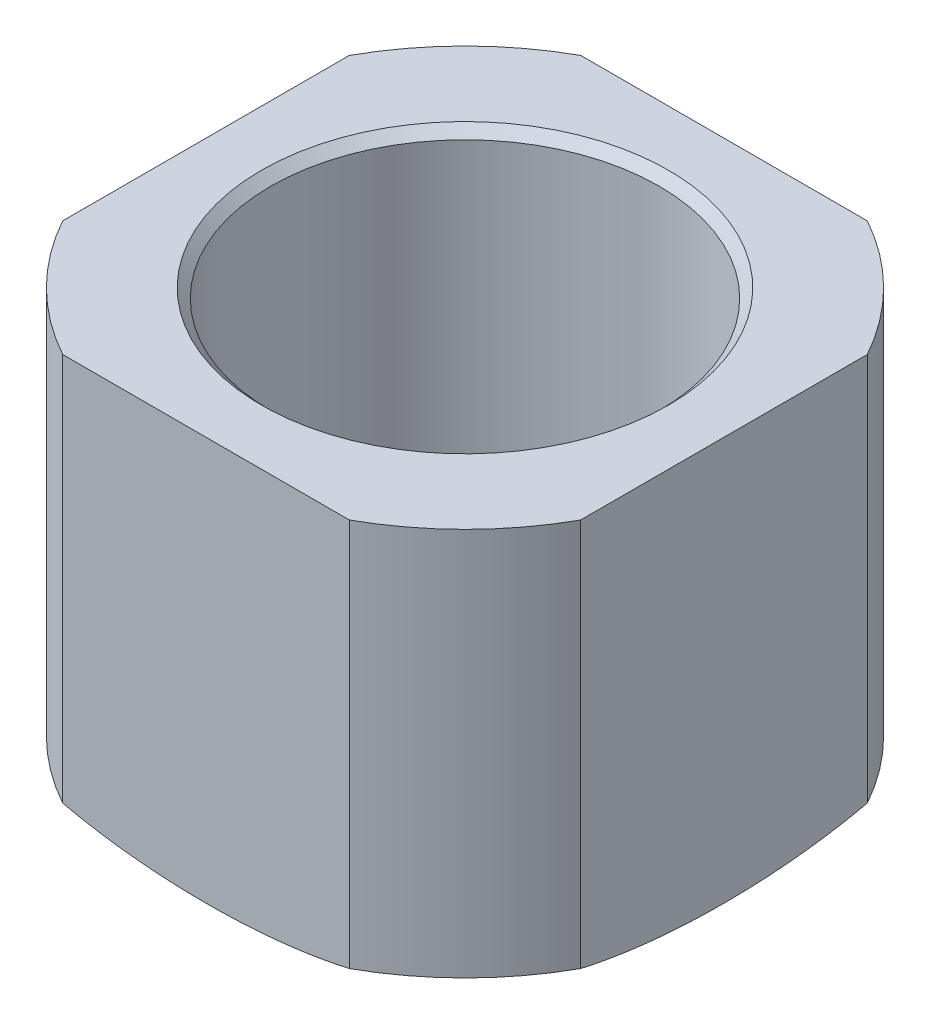
ISO-10303-21;
HEADER;
FILE_DESCRIPTION(('STEP AP214'),'2;1');
FILE_NAME('part.step','',(''),(''),'','','');
FILE_SCHEMA(('AUTOMOTIVE_DESIGN { 1 0 10303 214 1 1 1 1 }'));
ENDSEC;
DATA;
#1=APPLICATION_CONTEXT('core data for automotive mechanical design processes');
#2=APPLICATION_PROTOCOL_DEFINITION('international standard','automotive_design',2000,#1);
#3=PRODUCT_CONTEXT('',#1,'mechanical');
#4=PRODUCT('Part','Part','',(#3));
#5=PRODUCT_RELATED_PRODUCT_CATEGORY('part','',(#4));
#6=PRODUCT_DEFINITION_FORMATION('','',#4);
#7=PRODUCT_DEFINITION_CONTEXT('part definition',#1,'design');
#8=PRODUCT_DEFINITION('design','',#6,#7);
#9=PRODUCT_DEFINITION_SHAPE('','',#8);
#10=(LENGTH_UNIT() NAMED_UNIT(*) SI_UNIT(.MILLI.,.METRE.));
#11=(NAMED_UNIT(*) PLANE_ANGLE_UNIT() SI_UNIT($,.RADIAN.));
#12=(NAMED_UNIT(*) SI_UNIT($,.STERADIAN.) SOLID_ANGLE_UNIT());
#13=UNCERTAINTY_MEASURE_WITH_UNIT(LENGTH_MEASURE(1.E-05),#10,'distance_accuracy_value','');
#14=(GEOMETRIC_REPRESENTATION_CONTEXT(3) GLOBAL_UNCERTAINTY_ASSIGNED_CONTEXT((#13)) GLOBAL_UNIT_ASSIGNED_CONTEXT((#10,
#11,#12)) REPRESENTATION_CONTEXT('',''));
#15=CARTESIAN_POINT('',(0.,0.,0.));
#16=DIRECTION('',(0.,0.,1.));
#17=DIRECTION('',(1.,0.,0.));
#18=AXIS2_PLACEMENT_3D('',#15,#16,#17);
#19=CARTESIAN_POINT('',(0.,53.4636470303403,0.));
#20=DIRECTION('',(0.,1.,0.));
#21=DIRECTION('',(-1.,0.,0.));
#22=AXIS2_PLACEMENT_3D('',#19,#20,#21);
#23=CYLINDRICAL_SURFACE('',#22,25.4);
#24=CARTESIAN_POINT('',(0.,3.17499999999993,0.));
#25=DIRECTION('',(0.,1.,0.));
#26=DIRECTION('',(-1.,0.,0.));
#27=AXIS2_PLACEMENT_3D('',#24,#25,#26);
#28=CIRCLE('',#27,25.4);
#29=CARTESIAN_POINT('',(-22.225,3.17499999999671,12.2967221242085));
#30=VERTEX_POINT('',#29);
#31=CARTESIAN_POINT('',(-12.2967221242084,3.17499999999993,22.2250000000001));
#32=VERTEX_POINT('',#31);
#33=EDGE_CURVE('E223',#30,#32,#28,.T.);
#34=ORIENTED_EDGE('',*,*,#33,.T.);
#35=DIRECTION('',(0.,1.,0.));
#36=VECTOR('',#35,1.);
#37=CARTESIAN_POINT('',(-12.2967221242085,0.,22.2250000000001));
#38=LINE('',#37,#36);
#39=CARTESIAN_POINT('',(-12.2967221242085,36.5124999999999,22.2250000000001));
#40=VERTEX_POINT('',#39);
#41=EDGE_CURVE('E136',#32,#40,#38,.T.);
#42=ORIENTED_EDGE('',*,*,#41,.T.);
#43=CARTESIAN_POINT('',(0.,36.5124999999999,0.));
#44=DIRECTION('',(0.,1.,0.));
#45=DIRECTION('',(-1.,0.,0.));
#46=AXIS2_PLACEMENT_3D('',#43,#44,#45);
#47=CIRCLE('',#46,25.4);
#48=CARTESIAN_POINT('',(-22.225,36.5124999999999,12.2967221242085));
#49=VERTEX_POINT('',#48);
#50=EDGE_CURVE('E146',#49,#40,#47,.T.);
#51=ORIENTED_EDGE('',*,*,#50,.F.);
#52=DIRECTION('',(0.,1.,0.));
#53=VECTOR('',#52,1.);
#54=CARTESIAN_POINT('',(-22.225,0.,12.2967221242085));
#55=LINE('',#54,#53);
#56=EDGE_CURVE('E230',#30,#49,#55,.T.);
#57=ORIENTED_EDGE('',*,*,#56,.F.);
#58=EDGE_LOOP('',(#34,#42,#51,#57));
#59=FACE_BOUND('',#58,.T.);
#60=ADVANCED_FACE('F54',(#59),#23,.T.);
#61=CARTESIAN_POINT('',(12.2967221242086,36.5124999999999,22.225));
#62=VERTEX_POINT('',#61);
#63=CARTESIAN_POINT('',(22.225,36.5124999999999,12.2967221242085));
#64=VERTEX_POINT('',#63);
#65=EDGE_CURVE('E143',#62,#64,#47,.T.);
#66=ORIENTED_EDGE('',*,*,#65,.F.);
#67=DIRECTION('',(0.,1.,0.));
#68=VECTOR('',#67,1.);
#69=CARTESIAN_POINT('',(12.2967221242086,0.,22.225));
#70=LINE('',#69,#68);
#71=CARTESIAN_POINT('',(12.2967221242086,3.17500000000326,22.225));
#72=VERTEX_POINT('',#71);
#73=EDGE_CURVE('E126',#72,#62,#70,.T.);
#74=ORIENTED_EDGE('',*,*,#73,.F.);
#75=CARTESIAN_POINT('',(22.225,3.17499999999993,12.2967221242085));
#76=VERTEX_POINT('',#75);
#77=EDGE_CURVE('E219',#72,#76,#28,.T.);
#78=ORIENTED_EDGE('',*,*,#77,.T.);
#79=DIRECTION('',(0.,1.,0.));
#80=VECTOR('',#79,1.);
#81=CARTESIAN_POINT('',(22.225,0.,12.2967221242085));
#82=LINE('',#81,#80);
#83=EDGE_CURVE('E85',#76,#64,#82,.T.);
#84=ORIENTED_EDGE('',*,*,#83,.T.);
#85=EDGE_LOOP('',(#66,#74,#78,#84));
#86=FACE_BOUND('',#85,.T.);
#87=ADVANCED_FACE('F149',(#86),#23,.T.);
#88=CARTESIAN_POINT('',(22.225,36.5124999999999,-12.2967221242085));
#89=VERTEX_POINT('',#88);
#90=CARTESIAN_POINT('',(12.2967221242083,36.5124999999999,-22.2250000000001));
#91=VERTEX_POINT('',#90);
#92=EDGE_CURVE('E151',#89,#91,#47,.T.);
#93=ORIENTED_EDGE('',*,*,#92,.F.);
#94=DIRECTION('',(0.,1.,0.));
#95=VECTOR('',#94,1.);
#96=CARTESIAN_POINT('',(22.225,0.,-12.2967221242085));
#97=LINE('',#96,#95);
#98=CARTESIAN_POINT('',(22.225,3.17500000000326,-12.2967221242085));
#99=VERTEX_POINT('',#98);
#100=EDGE_CURVE('E217',#99,#89,#97,.T.);
#101=ORIENTED_EDGE('',*,*,#100,.F.);
#102=CARTESIAN_POINT('',(12.2967221242083,3.17499999999993,-22.2250000000001));
#103=VERTEX_POINT('',#102);
#104=EDGE_CURVE('E210',#99,#103,#28,.T.);
#105=ORIENTED_EDGE('',*,*,#104,.T.);
#106=DIRECTION('',(0.,1.,0.));
#107=VECTOR('',#106,1.);
#108=CARTESIAN_POINT('',(12.2967221242083,0.,-22.2250000000001));
#109=LINE('',#108,#107);
#110=EDGE_CURVE('E77',#103,#91,#109,.T.);
#111=ORIENTED_EDGE('',*,*,#110,.T.);
#112=EDGE_LOOP('',(#93,#101,#105,#111));
#113=FACE_BOUND('',#112,.T.);
#114=ADVANCED_FACE('F216',(#113),#23,.T.);
#115=CARTESIAN_POINT('',(-12.2967221242088,36.5124999999999,-22.2249999999999));
#116=VERTEX_POINT('',#115);
#117=CARTESIAN_POINT('',(-22.225,36.5124999999999,-12.2967221242085));
#118=VERTEX_POINT('',#117);
#119=EDGE_CURVE('E156',#116,#118,#47,.T.);
#120=ORIENTED_EDGE('',*,*,#119,.F.);
#121=DIRECTION('',(0.,1.,0.));
#122=VECTOR('',#121,1.);
#123=CARTESIAN_POINT('',(-12.2967221242088,0.,-22.2249999999999));
#124=LINE('',#123,#122);
#125=CARTESIAN_POINT('',(-12.2967221242088,3.17500000000326,-22.2249999999999));
#126=VERTEX_POINT('',#125);
#127=EDGE_CURVE('E259',#126,#116,#124,.T.);
#128=ORIENTED_EDGE('',*,*,#127,.F.);
#129=CARTESIAN_POINT('',(-22.225,3.17499999999993,-12.2967221242085));
#130=VERTEX_POINT('',#129);
#131=EDGE_CURVE('E211',#126,#130,#28,.T.);
#132=ORIENTED_EDGE('',*,*,#131,.T.);
#133=DIRECTION('',(0.,1.,0.));
#134=VECTOR('',#133,1.);
#135=CARTESIAN_POINT('',(-22.225,0.,-12.2967221242085));
#136=LINE('',#135,#134);
#137=EDGE_CURVE('E224',#130,#118,#136,.T.);
#138=ORIENTED_EDGE('',*,*,#137,.T.);
#139=EDGE_LOOP('',(#120,#128,#132,#138));
#140=FACE_BOUND('',#139,.T.);
#141=ADVANCED_FACE('F255',(#140),#23,.T.);
#142=CARTESIAN_POINT('',(25.4,36.5124999999999,0.));
#143=DIRECTION('',(0.,-1.,0.));
#144=DIRECTION('',(1.,0.,0.));
#145=AXIS2_PLACEMENT_3D('',#142,#143,#144);
#146=PLANE('',#145);
#147=CARTESIAN_POINT('',(0.,36.5124999999999,0.));
#148=DIRECTION('',(0.,-1.,0.));
#149=DIRECTION('',(1.,0.,0.));
#150=AXIS2_PLACEMENT_3D('',#147,#148,#149);
#151=CIRCLE('',#150,17.4625);
#152=CARTESIAN_POINT('',(17.4625,36.5124999999999,0.));
#153=VERTEX_POINT('',#152);
#154=EDGE_CURVE('E165',#153,#153,#151,.T.);
#155=ORIENTED_EDGE('',*,*,#154,.T.);
#156=EDGE_LOOP('',(#155));
#157=FACE_BOUND('',#156,.T.);
#158=ORIENTED_EDGE('',*,*,#50,.T.);
#159=DIRECTION('',(-1.,0.,0.));
#160=VECTOR('',#159,1.);
#161=CARTESIAN_POINT('',(-12.2967221242085,36.5124999999999,22.2250000000001));
#162=LINE('',#161,#160);
#163=EDGE_CURVE('E129',#62,#40,#162,.T.);
#164=ORIENTED_EDGE('',*,*,#163,.F.);
#165=ORIENTED_EDGE('',*,*,#65,.T.);
#166=DIRECTION('',(0.,0.,1.));
#167=VECTOR('',#166,1.);
#168=CARTESIAN_POINT('',(22.225,36.5124999999999,12.2967221242085));
#169=LINE('',#168,#167);
#170=EDGE_CURVE('E264',#89,#64,#169,.T.);
#171=ORIENTED_EDGE('',*,*,#170,.F.);
#172=ORIENTED_EDGE('',*,*,#92,.T.);
#173=DIRECTION('',(1.,0.,0.));
#174=VECTOR('',#173,1.);
#175=CARTESIAN_POINT('',(12.2967221242083,36.5124999999999,-22.2250000000001));
#176=LINE('',#175,#174);
#177=EDGE_CURVE('E248',#116,#91,#176,.T.);
#178=ORIENTED_EDGE('',*,*,#177,.F.);
#179=ORIENTED_EDGE('',*,*,#119,.T.);
#180=DIRECTION('',(0.,0.,-1.));
#181=VECTOR('',#180,1.);
#182=CARTESIAN_POINT('',(-22.225,36.5124999999999,-12.2967221242085));
#183=LINE('',#182,#181);
#184=EDGE_CURVE('E247',#49,#118,#183,.T.);
#185=ORIENTED_EDGE('',*,*,#184,.F.);
#186=EDGE_LOOP('',(#158,#164,#165,#171,#172,#178,#179,#185));
#187=FACE_BOUND('',#186,.T.);
#188=ADVANCED_FACE('F141',(#157,#187),#146,.F.);
#189=CARTESIAN_POINT('',(0.,53.4636470303403,0.));
#190=DIRECTION('',(0.,1.,0.));
#191=DIRECTION('',(-1.,0.,0.));
#192=AXIS2_PLACEMENT_3D('',#189,#190,#191);
#193=CYLINDRICAL_SURFACE('',#192,16.66875);
#194=CARTESIAN_POINT('',(0.,35.71875,0.));
#195=DIRECTION('',(0.,-1.,0.));
#196=DIRECTION('',(1.,0.,0.));
#197=AXIS2_PLACEMENT_3D('',#194,#195,#196);
#198=CIRCLE('',#197,16.66875);
#199=CARTESIAN_POINT('',(16.66875,35.71875,0.));
#200=VERTEX_POINT('',#199);
#201=EDGE_CURVE('E155',#200,#200,#198,.F.);
#202=ORIENTED_EDGE('',*,*,#201,.T.);
#203=EDGE_LOOP('',(#202));
#204=FACE_BOUND('',#203,.T.);
#205=CARTESIAN_POINT('',(0.,7.36193469088364,0.));
#206=DIRECTION('',(0.,1.,0.));
#207=DIRECTION('',(-1.,0.,0.));
#208=AXIS2_PLACEMENT_3D('',#205,#206,#207);
#209=CIRCLE('',#208,16.66875);
#210=CARTESIAN_POINT('',(-16.66875,7.36193469088364,0.));
#211=VERTEX_POINT('',#210);
#212=EDGE_CURVE('E160',#211,#211,#209,.T.);
#213=ORIENTED_EDGE('',*,*,#212,.F.);
#214=EDGE_LOOP('',(#213));
#215=FACE_BOUND('',#214,.T.);
#216=ADVANCED_FACE('F286',(#204,#215),#193,.F.);
#217=CARTESIAN_POINT('',(0.,7.36193469088364,0.));
#218=DIRECTION('',(0.,1.,0.));
#219=DIRECTION('',(-1.,0.,0.));
#220=AXIS2_PLACEMENT_3D('',#217,#218,#219);
#221=CONICAL_SURFACE('',#220,16.66875,0.925024503556993);
#222=CARTESIAN_POINT('',(0.,3.17500000000004,0.));
#223=DIRECTION('',(0.,1.,0.));
#224=DIRECTION('',(-1.,0.,0.));
#225=AXIS2_PLACEMENT_3D('',#222,#223,#224);
#226=CIRCLE('',#225,11.1125);
#227=CARTESIAN_POINT('',(-11.1125,3.17500000000004,0.));
#228=VERTEX_POINT('',#227);
#229=EDGE_CURVE('E234',#228,#228,#226,.T.);
#230=ORIENTED_EDGE('',*,*,#229,.F.);
#231=EDGE_LOOP('',(#230));
#232=FACE_BOUND('',#231,.T.);
#233=ORIENTED_EDGE('',*,*,#212,.T.);
#234=EDGE_LOOP('',(#233));
#235=FACE_BOUND('',#234,.T.);
#236=ADVANCED_FACE('F331',(#232,#235),#221,.F.);
#237=CARTESIAN_POINT('',(0.,53.4636470303403,0.));
#238=DIRECTION('',(0.,1.,0.));
#239=DIRECTION('',(-1.,0.,0.));
#240=AXIS2_PLACEMENT_3D('',#237,#238,#239);
#241=CYLINDRICAL_SURFACE('',#240,11.1125);
#242=CARTESIAN_POINT('',(0.,0.,0.));
#243=DIRECTION('',(0.,1.,0.));
#244=DIRECTION('',(-1.,0.,0.));
#245=AXIS2_PLACEMENT_3D('',#242,#243,#244);
#246=CIRCLE('',#245,11.1125);
#247=CARTESIAN_POINT('',(-11.1125,0.,0.));
#248=VERTEX_POINT('',#247);
#249=EDGE_CURVE('E229',#248,#248,#246,.T.);
#250=ORIENTED_EDGE('',*,*,#249,.F.);
#251=EDGE_LOOP('',(#250));
#252=FACE_BOUND('',#251,.T.);
#253=ORIENTED_EDGE('',*,*,#229,.T.);
#254=EDGE_LOOP('',(#253));
#255=FACE_BOUND('',#254,.T.);
#256=ADVANCED_FACE('F325',(#252,#255),#241,.F.);
#257=CARTESIAN_POINT('',(0.,33.734375,0.));
#258=DIRECTION('',(0.,1.,0.));
#259=DIRECTION('',(-1.,0.,0.));
#260=AXIS2_PLACEMENT_3D('',#257,#258,#259);
#261=DEGENERATE_TOROIDAL_SURFACE('',#260,11.1125,33.734375,.T.);
#262=ORIENTED_EDGE('',*,*,#77,.F.);
#263=CARTESIAN_POINT('',(37.0944648452123,23.4560335376029,22.2249999999999));
#264=CARTESIAN_POINT('',(36.9427406090926,23.0491737442462,22.2249999999999));
#265=CARTESIAN_POINT('',(36.7820996539557,22.6457018038872,22.2249999999999));
#266=CARTESIAN_POINT('',(36.4433291230189,21.8461795227203,22.2249999999999));
#267=CARTESIAN_POINT('',(36.2651999888968,21.4501289947794,22.2249999999999));
#268=CARTESIAN_POINT('',(35.7052777287728,20.2744517030549,22.2249999999999));
#269=CARTESIAN_POINT('',(35.2977926921347,19.5068786841613,22.2249999999999));
#270=CARTESIAN_POINT('',(34.4194942116798,18.0120619303547,22.2249999999999));
#271=CARTESIAN_POINT('',(33.9488697401149,17.2847066628165,22.2249999999999));
#272=CARTESIAN_POINT('',(32.9474896018599,15.8725891711159,22.2249999999999));
#273=CARTESIAN_POINT('',(32.4167315796435,15.1878286170845,22.2249999999999));
#274=CARTESIAN_POINT('',(31.3002168314646,13.8657416674758,22.2249999999999));
#275=CARTESIAN_POINT('',(30.7145056958536,13.228376724811,22.2249999999999));
#276=CARTESIAN_POINT('',(29.4927193195834,12.0039652926607,22.2249999999999));
#277=CARTESIAN_POINT('',(28.8566444685315,11.4169184139941,22.2249999999999));
#278=CARTESIAN_POINT('',(27.5394550540863,10.2959124837986,22.2249999999999));
#279=CARTESIAN_POINT('',(26.8583437595033,9.76194958638471,22.2249999999999));
#280=CARTESIAN_POINT('',(25.4564896208938,8.74893980289428,22.2249999999999));
#281=CARTESIAN_POINT('',(24.7357459008012,8.26989413147352,22.2249999999999));
#282=CARTESIAN_POINT('',(23.2259349525817,7.34679657759687,22.2249999999999));
#283=CARTESIAN_POINT('',(22.4352493431655,6.90539458314028,22.2249999999999));
#284=CARTESIAN_POINT('',(20.8227606970976,6.08382145016348,22.2249999999999));
#285=CARTESIAN_POINT('',(20.0009569492394,5.7036517121541,22.2249999999999));
#286=CARTESIAN_POINT('',(18.3316497752918,5.00316988839912,22.2249999999999));
#287=CARTESIAN_POINT('',(17.4841288474925,4.68289967928885,22.225));
#288=CARTESIAN_POINT('',(15.7694329422649,4.10028115664001,22.2249999999999));
#289=CARTESIAN_POINT('',(14.9022568328448,3.83793618855703,22.2249999999999));
#290=CARTESIAN_POINT('',(13.3099706845407,3.41006896580998,22.2249999999999));
#291=CARTESIAN_POINT('',(12.5872295813414,3.23562100835145,22.225));
#292=CARTESIAN_POINT('',(11.1341705415139,2.92142232072309,22.225));
#293=CARTESIAN_POINT('',(10.4038516435623,2.78167605030848,22.225));
#294=CARTESIAN_POINT('',(8.93729537713052,2.53452818134014,22.225));
#295=CARTESIAN_POINT('',(8.20105432822178,2.4271485993022,22.225));
#296=CARTESIAN_POINT('',(6.72483482116621,2.24258872880627,22.225));
#297=CARTESIAN_POINT('',(5.98485639916041,2.16540814888307,22.225));
#298=CARTESIAN_POINT('',(4.49978743006958,2.03902507475695,22.225));
#299=CARTESIAN_POINT('',(3.75468809481052,1.98992686627702,22.225));
#300=CARTESIAN_POINT('',(2.26325995118936,1.91868211268187,22.225));
#301=CARTESIAN_POINT('',(1.51693121770407,1.89653398282224,22.225));
#302=CARTESIAN_POINT('',(0.024266701922309,1.8784675063521,22.225));
#303=CARTESIAN_POINT('',(-0.722068951823672,1.88253840067763,22.225));
#304=CARTESIAN_POINT('',(-2.21433207718479,1.917022168746,22.225));
#305=CARTESIAN_POINT('',(-2.96025939426032,1.94744182348351,22.225));
#306=CARTESIAN_POINT('',(-4.33856990418,2.02898895840603,22.225));
#307=CARTESIAN_POINT('',(-4.97117608676727,2.07631899400823,22.225));
#308=CARTESIAN_POINT('',(-6.23449477004473,2.19171066246739,22.225));
#309=CARTESIAN_POINT('',(-6.86520714975961,2.25977359243039,22.225));
#310=CARTESIAN_POINT('',(-8.75293021784894,2.49690254128831,22.225));
#311=CARTESIAN_POINT('',(-10.0061445464069,2.69894284740412,22.225));
#312=CARTESIAN_POINT('',(-11.8679368036497,3.07578002541246,22.2250000000001));
#313=CARTESIAN_POINT('',(-12.4842423466609,3.21331958251471,22.2250000000001));
#314=CARTESIAN_POINT('',(-13.7104848885619,3.51434376569835,22.2250000000001));
#315=CARTESIAN_POINT('',(-14.3204224683134,3.67782600295455,22.2250000000001));
#316=CARTESIAN_POINT('',(-15.5322469474551,4.03192322681566,22.2250000000001));
#317=CARTESIAN_POINT('',(-16.1341355965602,4.22253220803362,22.2250000000001));
#318=CARTESIAN_POINT('',(-17.3282195603525,4.63191163467132,22.2250000000001));
#319=CARTESIAN_POINT('',(-17.9204152977103,4.85068084842415,22.2250000000001));
#320=CARTESIAN_POINT('',(-19.3903921792785,5.43539534565034,22.2250000000001));
#321=CARTESIAN_POINT('',(-20.2609444377151,5.81977249649518,22.2250000000001));
#322=CARTESIAN_POINT('',(-21.968989144851,6.65594819175012,22.2250000000001));
#323=CARTESIAN_POINT('',(-22.8064847412971,7.10774029704111,22.2250000000001));
#324=CARTESIAN_POINT('',(-24.4423657923875,8.07961233051808,22.2250000000001));
#325=CARTESIAN_POINT('',(-25.2407028986835,8.5997738969721,22.2250000000001));
#326=CARTESIAN_POINT('',(-26.7897986521876,9.70679128489497,22.2250000000001));
#327=CARTESIAN_POINT('',(-27.5405576523873,10.2936466114591,22.2250000000001));
#328=CARTESIAN_POINT('',(-28.9912346328662,11.5349906999661,22.2250000000001));
#329=CARTESIAN_POINT('',(-29.6908480005924,12.1898360479609,22.2250000000001));
#330=CARTESIAN_POINT('',(-31.027581679407,13.5607601122668,22.2250000000001));
#331=CARTESIAN_POINT('',(-31.6646926871685,14.2768479147687,22.2250000000001));
#332=CARTESIAN_POINT('',(-32.8685388075825,15.7638702976841,22.2250000000001));
#333=CARTESIAN_POINT('',(-33.4353927188895,16.534708728285,22.2250000000001));
#334=CARTESIAN_POINT('',(-34.4937219086369,18.1261372568254,22.2250000000001));
#335=CARTESIAN_POINT('',(-34.9852419341148,18.9466974135407,22.2250000000001));
#336=CARTESIAN_POINT('',(-35.5950926673051,20.0846117909386,22.2250000000001));
#337=CARTESIAN_POINT('',(-35.7488137236673,20.3833911903828,22.2250000000001));
#338=CARTESIAN_POINT('',(-36.0460800624198,20.985898475325,22.2250000000001));
#339=CARTESIAN_POINT('',(-36.1896280922391,21.2896249972919,22.2250000000001));
#340=CARTESIAN_POINT('',(-36.4661610186792,21.9012688208849,22.2250000000001));
#341=CARTESIAN_POINT('',(-36.5991621343186,22.2091788000639,22.2250000000001));
#342=CARTESIAN_POINT('',(-36.8547106173474,22.8294048227372,22.2250000000001));
#343=CARTESIAN_POINT('',(-36.977255119744,23.1417220466247,22.2250000000001));
#344=CARTESIAN_POINT('',(-37.0944648452121,23.4560335376029,22.2250000000001));
#345=B_SPLINE_CURVE_WITH_KNOTS('',3,(#263,#264,#265,#266,#267,#268,#269,#270,#271,#272,#273,
#274,#275,#276,#277,#278,#279,#280,#281,#282,#283,#284,#285,#286,#287,#288,#289,#290,#291,#292,
#293,#294,#295,#296,#297,#298,#299,#300,#301,#302,#303,#304,#305,#306,#307,#308,#309,#310,#311,
#312,#313,#314,#315,#316,#317,#318,#319,#320,#321,#322,#323,#324,#325,#326,#327,#328,#329,#330,
#331,#332,#333,#334,#335,#336,#337,#338,#339,#340,#341,#342,#343,#344),.UNSPECIFIED.,.F.,.F.,(4,
2,2,2,2,2,2,2,2,2,2,2,2,2,2,2,2,2,2,2,2,2,2,2,2,2,2,2,2,2,2,2,2,2,2,2,2,2,2,2,4),(0.,
1.30246786596649,2.60490284552947,5.20843069984539,7.80433331565317,10.4003376522532,
12.9942070142703,15.5880563124046,18.1817175514181,20.7754361458065,23.4893337829338,
26.2032934838112,28.919143518541,31.6351503654007,33.8647731524734,36.0946823357546,
38.3261049457295,40.5575060186325,42.7971406244674,45.0366435267916,47.2752275002046,
49.514387756428,51.4171615803759,53.3200544714668,57.1239877472942,59.0179446647017,
60.9117272859515,62.8050913071244,64.6983725448198,67.5503275884833,70.4020104026793,
73.2571298110247,76.112228034181,78.9831392210286,81.8544770898361,84.7208915455632,
87.5855967461837,88.5934833641568,89.601096736636,90.6071292789662,91.6134365835393),.UNSPECIFIED.);
#346=EDGE_CURVE('E13',#72,#32,#345,.T.);
#347=ORIENTED_EDGE('',*,*,#346,.T.);
#348=ORIENTED_EDGE('',*,*,#33,.F.);
#349=CARTESIAN_POINT('',(-22.225,23.4560335376029,37.0944648452122));
#350=CARTESIAN_POINT('',(-22.225,23.0491737442462,36.9427406090925));
#351=CARTESIAN_POINT('',(-22.225,22.6457018038872,36.7820996539557));
#352=CARTESIAN_POINT('',(-22.225,21.8461795227203,36.4433291230189));
#353=CARTESIAN_POINT('',(-22.225,21.4501289947794,36.2651999888968));
#354=CARTESIAN_POINT('',(-22.225,20.2744517030549,35.7052777287728));
#355=CARTESIAN_POINT('',(-22.225,19.5068786841613,35.2977926921346));
#356=CARTESIAN_POINT('',(-22.225,18.0120619303547,34.4194942116797));
#357=CARTESIAN_POINT('',(-22.225,17.2847066628165,33.9488697401148));
#358=CARTESIAN_POINT('',(-22.225,15.8725891711159,32.9474896018598));
#359=CARTESIAN_POINT('',(-22.225,15.1878286170845,32.4167315796434));
#360=CARTESIAN_POINT('',(-22.225,13.8657416674758,31.3002168314645));
#361=CARTESIAN_POINT('',(-22.225,13.228376724811,30.7145056958536));
#362=CARTESIAN_POINT('',(-22.225,12.0039652926607,29.4927193195834));
#363=CARTESIAN_POINT('',(-22.225,11.4169184139941,28.8566444685314));
#364=CARTESIAN_POINT('',(-22.225,10.2959124837986,27.5394550540862));
#365=CARTESIAN_POINT('',(-22.225,9.7619495863847,26.8583437595033));
#366=CARTESIAN_POINT('',(-22.225,8.74893980289428,25.4564896208937));
#367=CARTESIAN_POINT('',(-22.225,8.26989413147352,24.7357459008011));
#368=CARTESIAN_POINT('',(-22.225,7.34679657759687,23.2259349525817));
#369=CARTESIAN_POINT('',(-22.225,6.90539458314028,22.4352493431654));
#370=CARTESIAN_POINT('',(-22.225,6.08382145016348,20.8227606970976));
#371=CARTESIAN_POINT('',(-22.225,5.7036517121541,20.0009569492393));
#372=CARTESIAN_POINT('',(-22.225,5.00316988839912,18.3316497752917));
#373=CARTESIAN_POINT('',(-22.225,4.68289967928885,17.4841288474925));
#374=CARTESIAN_POINT('',(-22.225,4.10028115664002,15.7694329422648));
#375=CARTESIAN_POINT('',(-22.225,3.83793618855703,14.9022568328447));
#376=CARTESIAN_POINT('',(-22.225,3.41006896580997,13.3099706845407));
#377=CARTESIAN_POINT('',(-22.225,3.23562100835144,12.5872295813414));
#378=CARTESIAN_POINT('',(-22.225,2.92142232072308,11.1341705415138));
#379=CARTESIAN_POINT('',(-22.225,2.78167605030848,10.4038516435623));
#380=CARTESIAN_POINT('',(-22.225,2.53452818134015,8.93729537713047));
#381=CARTESIAN_POINT('',(-22.225,2.4271485993022,8.20105432822172));
#382=CARTESIAN_POINT('',(-22.225,2.24258872880626,6.72483482116616));
#383=CARTESIAN_POINT('',(-22.225,2.16540814888308,5.98485639916035));
#384=CARTESIAN_POINT('',(-22.225,2.03902507475695,4.49978743006953));
#385=CARTESIAN_POINT('',(-22.225,1.98992686627702,3.75468809481047));
#386=CARTESIAN_POINT('',(-22.225,1.91868211268187,2.26325995118932));
#387=CARTESIAN_POINT('',(-22.225,1.89653398282224,1.51693121770403));
#388=CARTESIAN_POINT('',(-22.225,1.87846750635209,0.0242667019222664));
#389=CARTESIAN_POINT('',(-22.225,1.88253840067763,-0.722068951823715));
#390=CARTESIAN_POINT('',(-22.225,1.917022168746,-2.21433207718483));
#391=CARTESIAN_POINT('',(-22.225,1.94744182348351,-2.96025939426036));
#392=CARTESIAN_POINT('',(-22.225,2.02898895840603,-4.33856990418005));
#393=CARTESIAN_POINT('',(-22.225,2.07631899400823,-4.97117608676732));
#394=CARTESIAN_POINT('',(-22.225,2.19171066246738,-6.23449477004478));
#395=CARTESIAN_POINT('',(-22.225,2.25977359243039,-6.86520714975966));
#396=CARTESIAN_POINT('',(-22.225,2.4969025412883,-8.75293021784899));
#397=CARTESIAN_POINT('',(-22.225,2.69894284740411,-10.0061445464069));
#398=CARTESIAN_POINT('',(-22.225,3.07578002541244,-11.8679368036498));
#399=CARTESIAN_POINT('',(-22.225,3.2133195825147,-12.484242346661));
#400=CARTESIAN_POINT('',(-22.225,3.51434376569834,-13.710484888562));
#401=CARTESIAN_POINT('',(-22.225,3.67782600295453,-14.3204224683135));
#402=CARTESIAN_POINT('',(-22.225,4.03192322681565,-15.5322469474552));
#403=CARTESIAN_POINT('',(-22.225,4.2225322080336,-16.1341355965603));
#404=CARTESIAN_POINT('',(-22.225,4.63191163467132,-17.3282195603526));
#405=CARTESIAN_POINT('',(-22.225,4.85068084842415,-17.9204152977104));
#406=CARTESIAN_POINT('',(-22.225,5.43539534565034,-19.3903921792786));
#407=CARTESIAN_POINT('',(-22.225,5.81977249649518,-20.2609444377152));
#408=CARTESIAN_POINT('',(-22.225,6.65594819175011,-21.968989144851));
#409=CARTESIAN_POINT('',(-22.225,7.10774029704111,-22.8064847412972));
#410=CARTESIAN_POINT('',(-22.225,8.07961233051808,-24.4423657923875));
#411=CARTESIAN_POINT('',(-22.225,8.59977389697209,-25.2407028986836));
#412=CARTESIAN_POINT('',(-22.225,9.70679128489496,-26.7897986521877));
#413=CARTESIAN_POINT('',(-22.225,10.2936466114591,-27.5405576523873));
#414=CARTESIAN_POINT('',(-22.225,11.5349906999661,-28.9912346328663));
#415=CARTESIAN_POINT('',(-22.225,12.1898360479609,-29.6908480005925));
#416=CARTESIAN_POINT('',(-22.225,13.5607601122668,-31.0275816794071));
#417=CARTESIAN_POINT('',(-22.225,14.2768479147687,-31.6646926871685));
#418=CARTESIAN_POINT('',(-22.225,15.763870297684,-32.8685388075825));
#419=CARTESIAN_POINT('',(-22.225,16.534708728285,-33.4353927188896));
#420=CARTESIAN_POINT('',(-22.225,18.1261372568254,-34.493721908637));
#421=CARTESIAN_POINT('',(-22.225,18.9466974135407,-34.9852419341148));
#422=CARTESIAN_POINT('',(-22.225,20.0846117909386,-35.5950926673052));
#423=CARTESIAN_POINT('',(-22.225,20.3833911903828,-35.7488137236674));
#424=CARTESIAN_POINT('',(-22.225,20.985898475325,-36.0460800624199));
#425=CARTESIAN_POINT('',(-22.225,21.2896249972919,-36.1896280922392));
#426=CARTESIAN_POINT('',(-22.225,21.9012688208849,-36.4661610186793));
#427=CARTESIAN_POINT('',(-22.225,22.2091788000639,-36.5991621343187));
#428=CARTESIAN_POINT('',(-22.225,22.8294048227372,-36.8547106173475));
#429=CARTESIAN_POINT('',(-22.225,23.1417220466247,-36.9772551197441));
#430=CARTESIAN_POINT('',(-22.225,23.4560335376029,-37.0944648452122));
#431=B_SPLINE_CURVE_WITH_KNOTS('',3,(#349,#350,#351,#352,#353,#354,#355,#356,#357,#358,#359,
#360,#361,#362,#363,#364,#365,#366,#367,#368,#369,#370,#371,#372,#373,#374,#375,#376,#377,#378,
#379,#380,#381,#382,#383,#384,#385,#386,#387,#388,#389,#390,#391,#392,#393,#394,#395,#396,#397,
#398,#399,#400,#401,#402,#403,#404,#405,#406,#407,#408,#409,#410,#411,#412,#413,#414,#415,#416,
#417,#418,#419,#420,#421,#422,#423,#424,#425,#426,#427,#428,#429,#430),.UNSPECIFIED.,.F.,.F.,(4,
2,2,2,2,2,2,2,2,2,2,2,2,2,2,2,2,2,2,2,2,2,2,2,2,2,2,2,2,2,2,2,2,2,2,2,2,2,2,2,4),(0.,
1.30246786596648,2.60490284552947,5.2084306998454,7.80433331565317,10.4003376522532,
12.9942070142703,15.5880563124046,18.1817175514181,20.7754361458065,23.4893337829338,
26.2032934838112,28.919143518541,31.6351503654007,33.8647731524734,36.0946823357546,
38.3261049457295,40.5575060186325,42.7971406244674,45.0366435267916,47.2752275002046,
49.514387756428,51.4171615803759,53.3200544714667,57.1239877472942,59.0179446647017,
60.9117272859515,62.8050913071244,64.6983725448198,67.5503275884833,70.4020104026793,
73.2571298110247,76.112228034181,78.9831392210286,81.8544770898361,84.7208915455632,
87.5855967461837,88.5934833641568,89.601096736636,90.6071292789662,91.6134365835393),.UNSPECIFIED.);
#432=EDGE_CURVE('E169',#30,#130,#431,.T.);
#433=ORIENTED_EDGE('',*,*,#432,.T.);
#434=ORIENTED_EDGE('',*,*,#131,.F.);
#435=CARTESIAN_POINT('',(-37.0944648452124,23.4560335376029,-22.2249999999996));
#436=CARTESIAN_POINT('',(-36.9427406090928,23.0491737442462,-22.2249999999996));
#437=CARTESIAN_POINT('',(-36.7820996539559,22.6457018038872,-22.2249999999996));
#438=CARTESIAN_POINT('',(-36.4433291230191,21.8461795227203,-22.2249999999996));
#439=CARTESIAN_POINT('',(-36.265199988897,21.4501289947794,-22.2249999999996));
#440=CARTESIAN_POINT('',(-35.705277728773,20.2744517030549,-22.2249999999996));
#441=CARTESIAN_POINT('',(-35.2977926921348,19.5068786841613,-22.2249999999996));
#442=CARTESIAN_POINT('',(-34.4194942116799,18.0120619303547,-22.2249999999996));
#443=CARTESIAN_POINT('',(-33.948869740115,17.2847066628165,-22.2249999999996));
#444=CARTESIAN_POINT('',(-32.94748960186,15.8725891711159,-22.2249999999997));
#445=CARTESIAN_POINT('',(-32.4167315796436,15.1878286170845,-22.2249999999997));
#446=CARTESIAN_POINT('',(-31.3002168314647,13.8657416674758,-22.2249999999997));
#447=CARTESIAN_POINT('',(-30.7145056958538,13.228376724811,-22.2249999999997));
#448=CARTESIAN_POINT('',(-29.4927193195836,12.0039652926607,-22.2249999999997));
#449=CARTESIAN_POINT('',(-28.8566444685316,11.4169184139941,-22.2249999999997));
#450=CARTESIAN_POINT('',(-27.5394550540864,10.2959124837986,-22.2249999999997));
#451=CARTESIAN_POINT('',(-26.8583437595035,9.76194958638471,-22.2249999999997));
#452=CARTESIAN_POINT('',(-25.4564896208939,8.74893980289428,-22.2249999999997));
#453=CARTESIAN_POINT('',(-24.7357459008013,8.26989413147352,-22.2249999999997));
#454=CARTESIAN_POINT('',(-23.2259349525819,7.34679657759687,-22.2249999999998));
#455=CARTESIAN_POINT('',(-22.4352493431657,6.90539458314028,-22.2249999999998));
#456=CARTESIAN_POINT('',(-20.8227606970978,6.08382145016348,-22.2249999999998));
#457=CARTESIAN_POINT('',(-20.0009569492395,5.70365171215409,-22.2249999999998));
#458=CARTESIAN_POINT('',(-18.331649775292,5.00316988839912,-22.2249999999998));
#459=CARTESIAN_POINT('',(-17.4841288474927,4.68289967928884,-22.2249999999998));
#460=CARTESIAN_POINT('',(-15.769432942265,4.10028115664001,-22.2249999999998));
#461=CARTESIAN_POINT('',(-14.9022568328449,3.83793618855703,-22.2249999999998));
#462=CARTESIAN_POINT('',(-13.3099706845409,3.41006896580997,-22.2249999999999));
#463=CARTESIAN_POINT('',(-12.5872295813416,3.23562100835144,-22.2249999999999));
#464=CARTESIAN_POINT('',(-11.134170541514,2.92142232072308,-22.2249999999999));
#465=CARTESIAN_POINT('',(-10.4038516435625,2.78167605030848,-22.2249999999999));
#466=CARTESIAN_POINT('',(-8.93729537713067,2.53452818134014,-22.2249999999999));
#467=CARTESIAN_POINT('',(-8.20105432822193,2.42714859930219,-22.2249999999999));
#468=CARTESIAN_POINT('',(-6.72483482116636,2.24258872880626,-22.2249999999999));
#469=CARTESIAN_POINT('',(-5.98485639916056,2.16540814888307,-22.2249999999999));
#470=CARTESIAN_POINT('',(-4.49978743006973,2.03902507475695,-22.225));
#471=CARTESIAN_POINT('',(-3.75468809481067,1.98992686627703,-22.225));
#472=CARTESIAN_POINT('',(-2.26325995118952,1.91868211268188,-22.225));
#473=CARTESIAN_POINT('',(-1.51693121770423,1.89653398282224,-22.225));
#474=CARTESIAN_POINT('',(-0.0242667019224626,1.8784675063521,-22.225));
#475=CARTESIAN_POINT('',(0.722068951823518,1.88253840067763,-22.225));
#476=CARTESIAN_POINT('',(2.21433207718463,1.917022168746,-22.225));
#477=CARTESIAN_POINT('',(2.96025939426016,1.94744182348351,-22.225));
#478=CARTESIAN_POINT('',(4.33856990417985,2.02898895840603,-22.225));
#479=CARTESIAN_POINT('',(4.97117608676712,2.07631899400822,-22.2250000000001));
#480=CARTESIAN_POINT('',(6.23449477004458,2.19171066246739,-22.2250000000001));
#481=CARTESIAN_POINT('',(6.86520714975945,2.25977359243039,-22.2250000000001));
#482=CARTESIAN_POINT('',(8.75293021784878,2.49690254128831,-22.2250000000001));
#483=CARTESIAN_POINT('',(10.0061445464067,2.69894284740411,-22.2250000000001));
#484=CARTESIAN_POINT('',(11.8679368036496,3.07578002541245,-22.2250000000001));
#485=CARTESIAN_POINT('',(12.4842423466608,3.21331958251471,-22.2250000000001));
#486=CARTESIAN_POINT('',(13.7104848885617,3.51434376569834,-22.2250000000001));
#487=CARTESIAN_POINT('',(14.3204224683133,3.67782600295454,-22.2250000000002));
#488=CARTESIAN_POINT('',(15.532246947455,4.03192322681566,-22.2250000000002));
#489=CARTESIAN_POINT('',(16.1341355965601,4.22253220803361,-22.2250000000002));
#490=CARTESIAN_POINT('',(17.3282195603524,4.63191163467132,-22.2250000000002));
#491=CARTESIAN_POINT('',(17.9204152977102,4.85068084842415,-22.2250000000002));
#492=CARTESIAN_POINT('',(19.3903921792783,5.43539534565034,-22.2250000000002));
#493=CARTESIAN_POINT('',(20.260944437715,5.81977249649517,-22.2250000000002));
#494=CARTESIAN_POINT('',(21.9689891448508,6.65594819175012,-22.2250000000002));
#495=CARTESIAN_POINT('',(22.806484741297,7.10774029704112,-22.2250000000002));
#496=CARTESIAN_POINT('',(24.4423657923873,8.07961233051809,-22.2250000000003));
#497=CARTESIAN_POINT('',(25.2407028986834,8.59977389697209,-22.2250000000003));
#498=CARTESIAN_POINT('',(26.7897986521875,9.70679128489495,-22.2250000000003));
#499=CARTESIAN_POINT('',(27.5405576523871,10.2936466114591,-22.2250000000003));
#500=CARTESIAN_POINT('',(28.991234632866,11.5349906999661,-22.2250000000003));
#501=CARTESIAN_POINT('',(29.6908480005923,12.1898360479609,-22.2250000000003));
#502=CARTESIAN_POINT('',(31.0275816794069,13.5607601122668,-22.2250000000003));
#503=CARTESIAN_POINT('',(31.6646926871683,14.2768479147687,-22.2250000000003));
#504=CARTESIAN_POINT('',(32.8685388075823,15.763870297684,-22.2250000000003));
#505=CARTESIAN_POINT('',(33.4353927188894,16.534708728285,-22.2250000000004));
#506=CARTESIAN_POINT('',(34.4937219086368,18.1261372568254,-22.2250000000004));
#507=CARTESIAN_POINT('',(34.9852419341146,18.9466974135407,-22.2250000000003));
#508=CARTESIAN_POINT('',(35.5950926673049,20.0846117909386,-22.2250000000004));
#509=CARTESIAN_POINT('',(35.7488137236671,20.3833911903828,-22.2250000000004));
#510=CARTESIAN_POINT('',(36.0460800624196,20.985898475325,-22.2250000000004));
#511=CARTESIAN_POINT('',(36.1896280922389,21.2896249972919,-22.2250000000004));
#512=CARTESIAN_POINT('',(36.4661610186791,21.9012688208849,-22.2250000000004));
#513=CARTESIAN_POINT('',(36.5991621343184,22.2091788000639,-22.2250000000004));
#514=CARTESIAN_POINT('',(36.8547106173472,22.8294048227372,-22.2250000000004));
#515=CARTESIAN_POINT('',(36.9772551197439,23.1417220466247,-22.2250000000004));
#516=CARTESIAN_POINT('',(37.094464845212,23.4560335376029,-22.2250000000004));
#517=B_SPLINE_CURVE_WITH_KNOTS('',3,(#435,#436,#437,#438,#439,#440,#441,#442,#443,#444,#445,
#446,#447,#448,#449,#450,#451,#452,#453,#454,#455,#456,#457,#458,#459,#460,#461,#462,#463,#464,
#465,#466,#467,#468,#469,#470,#471,#472,#473,#474,#475,#476,#477,#478,#479,#480,#481,#482,#483,
#484,#485,#486,#487,#488,#489,#490,#491,#492,#493,#494,#495,#496,#497,#498,#499,#500,#501,#502,
#503,#504,#505,#506,#507,#508,#509,#510,#511,#512,#513,#514,#515,#516),.UNSPECIFIED.,.F.,.F.,(4,
2,2,2,2,2,2,2,2,2,2,2,2,2,2,2,2,2,2,2,2,2,2,2,2,2,2,2,2,2,2,2,2,2,2,2,2,2,2,2,4),(0.,
1.30246786596649,2.60490284552947,5.2084306998454,7.80433331565317,10.4003376522532,
12.9942070142703,15.5880563124046,18.1817175514181,20.7754361458065,23.4893337829338,
26.2032934838112,28.919143518541,31.6351503654007,33.8647731524734,36.0946823357546,
38.3261049457296,40.5575060186326,42.7971406244674,45.0366435267916,47.2752275002046,
49.5143877564281,51.4171615803759,53.3200544714668,57.1239877472942,59.0179446647018,
60.9117272859515,62.8050913071244,64.6983725448198,67.5503275884833,70.4020104026794,
73.2571298110247,76.112228034181,78.9831392210286,81.8544770898361,84.7208915455632,
87.5855967461837,88.5934833641568,89.601096736636,90.6071292789662,91.6134365835394),.UNSPECIFIED.);
#518=EDGE_CURVE('E178',#126,#103,#517,.T.);
#519=ORIENTED_EDGE('',*,*,#518,.T.);
#520=ORIENTED_EDGE('',*,*,#104,.F.);
#521=CARTESIAN_POINT('',(22.225,23.4560335376029,-37.0944648452122));
#522=CARTESIAN_POINT('',(22.225,23.0491737442462,-36.9427406090925));
#523=CARTESIAN_POINT('',(22.225,22.6457018038872,-36.7820996539557));
#524=CARTESIAN_POINT('',(22.225,21.8461795227203,-36.4433291230189));
#525=CARTESIAN_POINT('',(22.225,21.4501289947794,-36.2651999888968));
#526=CARTESIAN_POINT('',(22.225,20.2744517030549,-35.7052777287728));
#527=CARTESIAN_POINT('',(22.225,19.5068786841613,-35.2977926921346));
#528=CARTESIAN_POINT('',(22.225,18.0120619303547,-34.4194942116797));
#529=CARTESIAN_POINT('',(22.225,17.2847066628165,-33.9488697401148));
#530=CARTESIAN_POINT('',(22.225,15.8725891711159,-32.9474896018598));
#531=CARTESIAN_POINT('',(22.225,15.1878286170845,-32.4167315796434));
#532=CARTESIAN_POINT('',(22.225,13.8657416674758,-31.3002168314645));
#533=CARTESIAN_POINT('',(22.225,13.228376724811,-30.7145056958536));
#534=CARTESIAN_POINT('',(22.225,12.0039652926607,-29.4927193195834));
#535=CARTESIAN_POINT('',(22.225,11.4169184139941,-28.8566444685314));
#536=CARTESIAN_POINT('',(22.225,10.2959124837986,-27.5394550540862));
#537=CARTESIAN_POINT('',(22.225,9.76194958638472,-26.8583437595033));
#538=CARTESIAN_POINT('',(22.225,8.74893980289429,-25.4564896208937));
#539=CARTESIAN_POINT('',(22.225,8.26989413147352,-24.7357459008011));
#540=CARTESIAN_POINT('',(22.225,7.34679657759687,-23.2259349525817));
#541=CARTESIAN_POINT('',(22.225,6.90539458314029,-22.4352493431654));
#542=CARTESIAN_POINT('',(22.225,6.08382145016349,-20.8227606970976));
#543=CARTESIAN_POINT('',(22.225,5.70365171215411,-20.0009569492393));
#544=CARTESIAN_POINT('',(22.225,5.00316988839912,-18.3316497752918));
#545=CARTESIAN_POINT('',(22.225,4.68289967928885,-17.4841288474925));
#546=CARTESIAN_POINT('',(22.225,4.10028115664002,-15.7694329422648));
#547=CARTESIAN_POINT('',(22.225,3.83793618855703,-14.9022568328447));
#548=CARTESIAN_POINT('',(22.225,3.41006896580997,-13.3099706845407));
#549=CARTESIAN_POINT('',(22.225,3.23562100835144,-12.5872295813414));
#550=CARTESIAN_POINT('',(22.225,2.92142232072308,-11.1341705415138));
#551=CARTESIAN_POINT('',(22.225,2.78167605030848,-10.4038516435623));
#552=CARTESIAN_POINT('',(22.225,2.53452818134015,-8.93729537713046));
#553=CARTESIAN_POINT('',(22.225,2.4271485993022,-8.20105432822171));
#554=CARTESIAN_POINT('',(22.225,2.24258872880627,-6.72483482116615));
#555=CARTESIAN_POINT('',(22.225,2.16540814888307,-5.98485639916035));
#556=CARTESIAN_POINT('',(22.225,2.03902507475695,-4.49978743006953));
#557=CARTESIAN_POINT('',(22.225,1.98992686627702,-3.75468809481047));
#558=CARTESIAN_POINT('',(22.225,1.91868211268188,-2.26325995118932));
#559=CARTESIAN_POINT('',(22.225,1.89653398282224,-1.51693121770402));
#560=CARTESIAN_POINT('',(22.225,1.8784675063521,-0.0242667019222647));
#561=CARTESIAN_POINT('',(22.225,1.88253840067763,0.722068951823715));
#562=CARTESIAN_POINT('',(22.225,1.917022168746,2.21433207718483));
#563=CARTESIAN_POINT('',(22.225,1.94744182348352,2.96025939426036));
#564=CARTESIAN_POINT('',(22.225,2.02898895840603,4.33856990418005));
#565=CARTESIAN_POINT('',(22.225,2.07631899400822,4.97117608676732));
#566=CARTESIAN_POINT('',(22.225,2.19171066246738,6.23449477004478));
#567=CARTESIAN_POINT('',(22.225,2.25977359243038,6.86520714975966));
#568=CARTESIAN_POINT('',(22.225,2.4969025412883,8.75293021784898));
#569=CARTESIAN_POINT('',(22.225,2.69894284740411,10.0061445464069));
#570=CARTESIAN_POINT('',(22.225,3.07578002541244,11.8679368036498));
#571=CARTESIAN_POINT('',(22.225,3.2133195825147,12.484242346661));
#572=CARTESIAN_POINT('',(22.225,3.51434376569834,13.710484888562));
#573=CARTESIAN_POINT('',(22.225,3.67782600295453,14.3204224683135));
#574=CARTESIAN_POINT('',(22.225,4.03192322681565,15.5322469474552));
#575=CARTESIAN_POINT('',(22.225,4.2225322080336,16.1341355965603));
#576=CARTESIAN_POINT('',(22.225,4.63191163467132,17.3282195603526));
#577=CARTESIAN_POINT('',(22.225,4.85068084842415,17.9204152977104));
#578=CARTESIAN_POINT('',(22.225,5.43539534565034,19.3903921792786));
#579=CARTESIAN_POINT('',(22.225,5.81977249649518,20.2609444377152));
#580=CARTESIAN_POINT('',(22.225,6.65594819175011,21.968989144851));
#581=CARTESIAN_POINT('',(22.225,7.10774029704111,22.8064847412972));
#582=CARTESIAN_POINT('',(22.225,8.07961233051808,24.4423657923875));
#583=CARTESIAN_POINT('',(22.225,8.59977389697209,25.2407028986836));
#584=CARTESIAN_POINT('',(22.225,9.70679128489496,26.7897986521877));
#585=CARTESIAN_POINT('',(22.225,10.2936466114591,27.5405576523873));
#586=CARTESIAN_POINT('',(22.225,11.5349906999661,28.9912346328663));
#587=CARTESIAN_POINT('',(22.225,12.1898360479609,29.6908480005925));
#588=CARTESIAN_POINT('',(22.225,13.5607601122668,31.0275816794071));
#589=CARTESIAN_POINT('',(22.225,14.2768479147687,31.6646926871685));
#590=CARTESIAN_POINT('',(22.225,15.763870297684,32.8685388075825));
#591=CARTESIAN_POINT('',(22.225,16.534708728285,33.4353927188896));
#592=CARTESIAN_POINT('',(22.225,18.1261372568254,34.493721908637));
#593=CARTESIAN_POINT('',(22.225,18.9466974135407,34.9852419341148));
#594=CARTESIAN_POINT('',(22.225,20.0846117909386,35.5950926673052));
#595=CARTESIAN_POINT('',(22.225,20.3833911903828,35.7488137236674));
#596=CARTESIAN_POINT('',(22.225,20.985898475325,36.0460800624199));
#597=CARTESIAN_POINT('',(22.225,21.2896249972919,36.1896280922392));
#598=CARTESIAN_POINT('',(22.225,21.9012688208849,36.4661610186793));
#599=CARTESIAN_POINT('',(22.225,22.2091788000639,36.5991621343187));
#600=CARTESIAN_POINT('',(22.225,22.8294048227372,36.8547106173475));
#601=CARTESIAN_POINT('',(22.225,23.1417220466247,36.9772551197441));
#602=CARTESIAN_POINT('',(22.225,23.4560335376029,37.0944648452122));
#603=B_SPLINE_CURVE_WITH_KNOTS('',3,(#521,#522,#523,#524,#525,#526,#527,#528,#529,#530,#531,
#532,#533,#534,#535,#536,#537,#538,#539,#540,#541,#542,#543,#544,#545,#546,#547,#548,#549,#550,
#551,#552,#553,#554,#555,#556,#557,#558,#559,#560,#561,#562,#563,#564,#565,#566,#567,#568,#569,
#570,#571,#572,#573,#574,#575,#576,#577,#578,#579,#580,#581,#582,#583,#584,#585,#586,#587,#588,
#589,#590,#591,#592,#593,#594,#595,#596,#597,#598,#599,#600,#601,#602),.UNSPECIFIED.,.F.,.F.,(4,
2,2,2,2,2,2,2,2,2,2,2,2,2,2,2,2,2,2,2,2,2,2,2,2,2,2,2,2,2,2,2,2,2,2,2,2,2,2,2,4),(0.,
1.30246786596648,2.60490284552947,5.2084306998454,7.80433331565317,10.4003376522532,
12.9942070142703,15.5880563124046,18.1817175514181,20.7754361458065,23.4893337829338,
26.2032934838112,28.919143518541,31.6351503654007,33.8647731524734,36.0946823357546,
38.3261049457296,40.5575060186326,42.7971406244674,45.0366435267916,47.2752275002046,
49.514387756428,51.4171615803759,53.3200544714668,57.1239877472942,59.0179446647018,
60.9117272859515,62.8050913071244,64.6983725448198,67.5503275884834,70.4020104026794,
73.2571298110248,76.112228034181,78.9831392210287,81.8544770898361,84.7208915455633,
87.5855967461838,88.5934833641569,89.601096736636,90.6071292789662,91.6134365835394),.UNSPECIFIED.);
#604=EDGE_CURVE('E70',#99,#76,#603,.T.);
#605=ORIENTED_EDGE('',*,*,#604,.T.);
#606=EDGE_LOOP('',(#262,#347,#348,#433,#434,#519,#520,#605));
#607=FACE_BOUND('',#606,.T.);
#608=ORIENTED_EDGE('',*,*,#249,.T.);
#609=EDGE_LOOP('',(#608));
#610=FACE_BOUND('',#609,.T.);
#611=ADVANCED_FACE('F184',(#607,#610),#261,.T.);
#612=CARTESIAN_POINT('',(0.,35.71875,0.));
#613=DIRECTION('',(0.,1.,0.));
#614=DIRECTION('',(-1.,0.,0.));
#615=AXIS2_PLACEMENT_3D('',#612,#613,#614);
#616=CONICAL_SURFACE('',#615,16.66875,0.78539816339744);
#617=ORIENTED_EDGE('',*,*,#154,.F.);
#618=EDGE_LOOP('',(#617));
#619=FACE_BOUND('',#618,.T.);
#620=ORIENTED_EDGE('',*,*,#201,.F.);
#621=EDGE_LOOP('',(#620));
#622=FACE_BOUND('',#621,.T.);
#623=ADVANCED_FACE('F57',(#619,#622),#616,.F.);
#624=CARTESIAN_POINT('',(-22.225,0.,-12.2967221242085));
#625=DIRECTION('',(1.,0.,0.));
#626=DIRECTION('',(0.,1.,0.));
#627=AXIS2_PLACEMENT_3D('',#624,#625,#626);
#628=PLANE('',#627);
#629=ORIENTED_EDGE('',*,*,#56,.T.);
#630=ORIENTED_EDGE('',*,*,#184,.T.);
#631=ORIENTED_EDGE('',*,*,#137,.F.);
#632=ORIENTED_EDGE('',*,*,#432,.F.);
#633=EDGE_LOOP('',(#629,#630,#631,#632));
#634=FACE_BOUND('',#633,.T.);
#635=ADVANCED_FACE('F187',(#634),#628,.F.);
#636=CARTESIAN_POINT('',(12.2967221242083,0.,-22.2250000000001));
#637=DIRECTION('',(0.,0.,1.));
#638=DIRECTION('',(1.,0.,0.));
#639=AXIS2_PLACEMENT_3D('',#636,#637,#638);
#640=PLANE('',#639);
#641=ORIENTED_EDGE('',*,*,#127,.T.);
#642=ORIENTED_EDGE('',*,*,#177,.T.);
#643=ORIENTED_EDGE('',*,*,#110,.F.);
#644=ORIENTED_EDGE('',*,*,#518,.F.);
#645=EDGE_LOOP('',(#641,#642,#643,#644));
#646=FACE_BOUND('',#645,.T.);
#647=ADVANCED_FACE('F190',(#646),#640,.F.);
#648=CARTESIAN_POINT('',(22.225,0.,12.2967221242085));
#649=DIRECTION('',(-1.,0.,0.));
#650=DIRECTION('',(0.,-1.,0.));
#651=AXIS2_PLACEMENT_3D('',#648,#649,#650);
#652=PLANE('',#651);
#653=ORIENTED_EDGE('',*,*,#100,.T.);
#654=ORIENTED_EDGE('',*,*,#170,.T.);
#655=ORIENTED_EDGE('',*,*,#83,.F.);
#656=ORIENTED_EDGE('',*,*,#604,.F.);
#657=EDGE_LOOP('',(#653,#654,#655,#656));
#658=FACE_BOUND('',#657,.T.);
#659=ADVANCED_FACE('F195',(#658),#652,.F.);
#660=CARTESIAN_POINT('',(-12.2967221242085,0.,22.2250000000001));
#661=DIRECTION('',(0.,0.,-1.));
#662=DIRECTION('',(-1.,0.,0.));
#663=AXIS2_PLACEMENT_3D('',#660,#661,#662);
#664=PLANE('',#663);
#665=ORIENTED_EDGE('',*,*,#73,.T.);
#666=ORIENTED_EDGE('',*,*,#163,.T.);
#667=ORIENTED_EDGE('',*,*,#41,.F.);
#668=ORIENTED_EDGE('',*,*,#346,.F.);
#669=EDGE_LOOP('',(#665,#666,#667,#668));
#670=FACE_BOUND('',#669,.T.);
#671=ADVANCED_FACE('F128',(#670),#664,.F.);
#672=CLOSED_SHELL('',(#60,#87,#114,#141,#188,#216,#236,#256,#611,#623,#635,#647,#659,#671));
#673=MANIFOLD_SOLID_BREP('B2',#672);
#674=ADVANCED_BREP_SHAPE_REPRESENTATION('',(#18,#673),#14);
#675=SHAPE_DEFINITION_REPRESENTATION(#9,#674);
ENDSEC;
END-ISO-10303-21;
